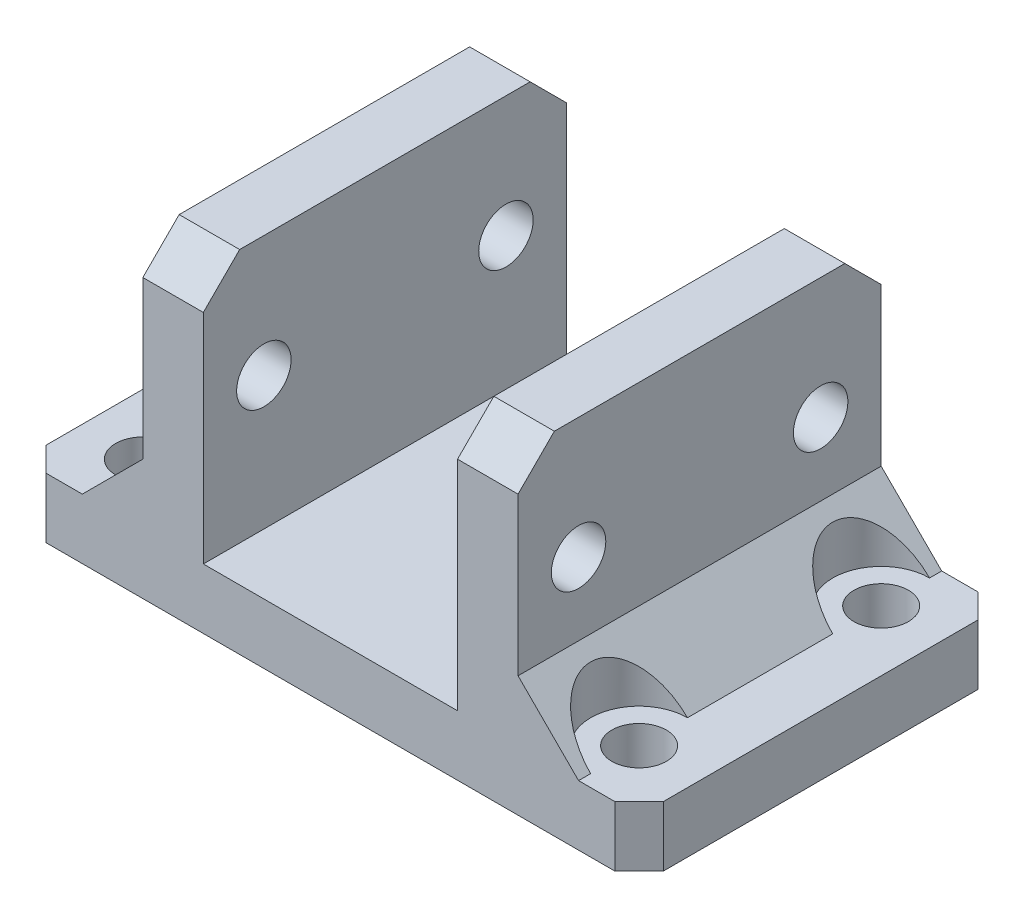
ISO-10303-21;
HEADER;
FILE_DESCRIPTION(('STEP AP214'),'2;1');
FILE_NAME('part.step','',(''),(''),'','','');
FILE_SCHEMA(('AUTOMOTIVE_DESIGN { 1 0 10303 214 1 1 1 1 }'));
ENDSEC;
DATA;
#1=APPLICATION_CONTEXT('core data for automotive mechanical design processes');
#2=APPLICATION_PROTOCOL_DEFINITION('international standard','automotive_design',2000,#1);
#3=PRODUCT_CONTEXT('',#1,'mechanical');
#4=PRODUCT('Part','Part','',(#3));
#5=PRODUCT_RELATED_PRODUCT_CATEGORY('part','',(#4));
#6=PRODUCT_DEFINITION_FORMATION('','',#4);
#7=PRODUCT_DEFINITION_CONTEXT('part definition',#1,'design');
#8=PRODUCT_DEFINITION('design','',#6,#7);
#9=PRODUCT_DEFINITION_SHAPE('','',#8);
#10=(LENGTH_UNIT() NAMED_UNIT(*) SI_UNIT(.MILLI.,.METRE.));
#11=(NAMED_UNIT(*) PLANE_ANGLE_UNIT() SI_UNIT($,.RADIAN.));
#12=(NAMED_UNIT(*) SI_UNIT($,.STERADIAN.) SOLID_ANGLE_UNIT());
#13=UNCERTAINTY_MEASURE_WITH_UNIT(LENGTH_MEASURE(1.E-05),#10,'distance_accuracy_value','');
#14=(GEOMETRIC_REPRESENTATION_CONTEXT(3) GLOBAL_UNCERTAINTY_ASSIGNED_CONTEXT((#13)) GLOBAL_UNIT_ASSIGNED_CONTEXT((#10,
#11,#12)) REPRESENTATION_CONTEXT('',''));
#15=CARTESIAN_POINT('',(0.,0.,0.));
#16=DIRECTION('',(0.,0.,1.));
#17=DIRECTION('',(1.,0.,0.));
#18=AXIS2_PLACEMENT_3D('',#15,#16,#17);
#19=CARTESIAN_POINT('',(-21.,-16.,-25.));
#20=DIRECTION('',(0.,1.,0.));
#21=DIRECTION('',(-1.,0.,0.));
#22=AXIS2_PLACEMENT_3D('',#19,#20,#21);
#23=CYLINDRICAL_SURFACE('',#22,2.25);
#24=CARTESIAN_POINT('',(-21.,-15.9757649115337,-25.));
#25=DIRECTION('',(0.,1.,0.));
#26=DIRECTION('',(0.,0.,1.));
#27=AXIS2_PLACEMENT_3D('',#24,#25,#26);
#28=CIRCLE('',#27,2.25);
#29=CARTESIAN_POINT('',(-21.,-15.9757649115337,-22.75));
#30=VERTEX_POINT('',#29);
#31=EDGE_CURVE('E432',#30,#30,#28,.F.);
#32=ORIENTED_EDGE('',*,*,#31,.T.);
#33=EDGE_LOOP('',(#32));
#34=FACE_BOUND('',#33,.T.);
#35=CARTESIAN_POINT('',(-21.,-11.,-25.));
#36=DIRECTION('',(0.,1.,0.));
#37=DIRECTION('',(-1.,0.,0.));
#38=AXIS2_PLACEMENT_3D('',#35,#36,#37);
#39=CIRCLE('',#38,2.25);
#40=CARTESIAN_POINT('',(-23.25,-11.,-25.));
#41=VERTEX_POINT('',#40);
#42=EDGE_CURVE('E436',#41,#41,#39,.F.);
#43=ORIENTED_EDGE('',*,*,#42,.F.);
#44=EDGE_LOOP('',(#43));
#45=FACE_BOUND('',#44,.T.);
#46=ADVANCED_FACE('F56',(#34,#45),#23,.F.);
#47=CARTESIAN_POINT('',(20.,-16.,-4.99999999999999));
#48=DIRECTION('',(0.,1.,0.));
#49=DIRECTION('',(-1.,0.,0.));
#50=AXIS2_PLACEMENT_3D('',#47,#48,#49);
#51=CYLINDRICAL_SURFACE('',#50,2.25);
#52=CARTESIAN_POINT('',(20.,-15.9757649115337,-4.99999999999999));
#53=DIRECTION('',(0.,1.,0.));
#54=DIRECTION('',(0.,0.,1.));
#55=AXIS2_PLACEMENT_3D('',#52,#53,#54);
#56=CIRCLE('',#55,2.25);
#57=CARTESIAN_POINT('',(20.,-15.9757649115337,-2.74999999999999));
#58=VERTEX_POINT('',#57);
#59=EDGE_CURVE('E428',#58,#58,#56,.T.);
#60=ORIENTED_EDGE('',*,*,#59,.F.);
#61=EDGE_LOOP('',(#60));
#62=FACE_BOUND('',#61,.T.);
#63=CARTESIAN_POINT('',(20.,-11.,-4.99999999999999));
#64=DIRECTION('',(0.,1.,0.));
#65=DIRECTION('',(-1.,0.,0.));
#66=AXIS2_PLACEMENT_3D('',#63,#64,#65);
#67=CIRCLE('',#66,2.25);
#68=CARTESIAN_POINT('',(17.75,-11.,-4.99999999999999));
#69=VERTEX_POINT('',#68);
#70=EDGE_CURVE('E568',#69,#69,#67,.T.);
#71=ORIENTED_EDGE('',*,*,#70,.T.);
#72=EDGE_LOOP('',(#71));
#73=FACE_BOUND('',#72,.T.);
#74=ADVANCED_FACE('F632',(#62,#73),#51,.F.);
#75=CARTESIAN_POINT('',(20.,-16.,-25.));
#76=DIRECTION('',(0.,1.,0.));
#77=DIRECTION('',(-1.,0.,0.));
#78=AXIS2_PLACEMENT_3D('',#75,#76,#77);
#79=CYLINDRICAL_SURFACE('',#78,2.25);
#80=CARTESIAN_POINT('',(20.,-15.9757649115337,-25.));
#81=DIRECTION('',(0.,1.,0.));
#82=DIRECTION('',(0.,0.,1.));
#83=AXIS2_PLACEMENT_3D('',#80,#81,#82);
#84=CIRCLE('',#83,2.25);
#85=CARTESIAN_POINT('',(20.,-15.9757649115337,-22.75));
#86=VERTEX_POINT('',#85);
#87=EDGE_CURVE('E424',#86,#86,#84,.T.);
#88=ORIENTED_EDGE('',*,*,#87,.F.);
#89=EDGE_LOOP('',(#88));
#90=FACE_BOUND('',#89,.T.);
#91=CARTESIAN_POINT('',(20.,-11.,-25.));
#92=DIRECTION('',(0.,1.,0.));
#93=DIRECTION('',(-1.,0.,0.));
#94=AXIS2_PLACEMENT_3D('',#91,#92,#93);
#95=CIRCLE('',#94,2.25);
#96=CARTESIAN_POINT('',(17.75,-11.,-25.));
#97=VERTEX_POINT('',#96);
#98=EDGE_CURVE('E564',#97,#97,#95,.T.);
#99=ORIENTED_EDGE('',*,*,#98,.T.);
#100=EDGE_LOOP('',(#99));
#101=FACE_BOUND('',#100,.T.);
#102=ADVANCED_FACE('F638',(#90,#101),#79,.F.);
#103=CARTESIAN_POINT('',(-21.,-16.,-4.99999999999998));
#104=DIRECTION('',(0.,1.,0.));
#105=DIRECTION('',(-1.,0.,0.));
#106=AXIS2_PLACEMENT_3D('',#103,#104,#105);
#107=CYLINDRICAL_SURFACE('',#106,2.25);
#108=CARTESIAN_POINT('',(-21.,-15.9757649115337,-4.99999999999998));
#109=DIRECTION('',(0.,1.,0.));
#110=DIRECTION('',(0.,0.,1.));
#111=AXIS2_PLACEMENT_3D('',#108,#109,#110);
#112=CIRCLE('',#111,2.25);
#113=CARTESIAN_POINT('',(-21.,-15.9757649115337,-2.74999999999998));
#114=VERTEX_POINT('',#113);
#115=EDGE_CURVE('E419',#114,#114,#112,.F.);
#116=ORIENTED_EDGE('',*,*,#115,.T.);
#117=EDGE_LOOP('',(#116));
#118=FACE_BOUND('',#117,.T.);
#119=CARTESIAN_POINT('',(-21.,-11.,-4.99999999999998));
#120=DIRECTION('',(0.,1.,0.));
#121=DIRECTION('',(-1.,0.,0.));
#122=AXIS2_PLACEMENT_3D('',#119,#120,#121);
#123=CIRCLE('',#122,2.25);
#124=CARTESIAN_POINT('',(-23.25,-11.,-4.99999999999998));
#125=VERTEX_POINT('',#124);
#126=EDGE_CURVE('E563',#125,#125,#123,.F.);
#127=ORIENTED_EDGE('',*,*,#126,.F.);
#128=EDGE_LOOP('',(#127));
#129=FACE_BOUND('',#128,.T.);
#130=ADVANCED_FACE('F761',(#118,#129),#107,.F.);
#131=CARTESIAN_POINT('',(20.,-11.,-30.));
#132=DIRECTION('',(0.707106781186544,0.707106781186551,0.));
#133=DIRECTION('',(0.,0.,-1.));
#134=AXIS2_PLACEMENT_3D('',#131,#132,#133);
#135=PLANE('',#134);
#136=CARTESIAN_POINT('',(20.,-11.,-25.));
#137=DIRECTION('',(0.707106781186544,0.707106781186551,0.));
#138=DIRECTION('',(0.707106781186552,-0.707106781186544,0.));
#139=AXIS2_PLACEMENT_3D('',#136,#137,#138);
#140=ELLIPSE('',#139,5.65685424949235,4.);
#141=CARTESIAN_POINT('',(20.,-11.,-29.));
#142=VERTEX_POINT('',#141);
#143=CARTESIAN_POINT('',(20.,-11.,-21.));
#144=VERTEX_POINT('',#143);
#145=EDGE_CURVE('E240',#142,#144,#140,.T.);
#146=ORIENTED_EDGE('',*,*,#145,.F.);
#147=DIRECTION('',(0.,0.,1.));
#148=VECTOR('',#147,1.);
#149=CARTESIAN_POINT('',(20.,-11.,0.));
#150=LINE('',#149,#148);
#151=CARTESIAN_POINT('',(20.,-11.,-30.));
#152=VERTEX_POINT('',#151);
#153=EDGE_CURVE('E261',#152,#142,#150,.T.);
#154=ORIENTED_EDGE('',*,*,#153,.F.);
#155=DIRECTION('',(-0.707106781186552,0.707106781186544,0.));
#156=VECTOR('',#155,1.);
#157=CARTESIAN_POINT('',(4.49999999999991,4.49999999999995,-30.));
#158=LINE('',#157,#156);
#159=CARTESIAN_POINT('',(15.,-6.00000000000003,-30.));
#160=VERTEX_POINT('',#159);
#161=EDGE_CURVE('E241',#160,#152,#158,.F.);
#162=ORIENTED_EDGE('',*,*,#161,.F.);
#163=DIRECTION('',(0.,0.,-1.));
#164=VECTOR('',#163,1.);
#165=CARTESIAN_POINT('',(15.,-6.00000000000003,-30.));
#166=LINE('',#165,#164);
#167=CARTESIAN_POINT('',(15.,-6.00000000000003,0.));
#168=VERTEX_POINT('',#167);
#169=EDGE_CURVE('E73',#168,#160,#166,.T.);
#170=ORIENTED_EDGE('',*,*,#169,.F.);
#171=DIRECTION('',(0.707106781186552,-0.707106781186544,0.));
#172=VECTOR('',#171,1.);
#173=CARTESIAN_POINT('',(20.,-11.,0.));
#174=LINE('',#173,#172);
#175=CARTESIAN_POINT('',(20.,-11.,0.));
#176=VERTEX_POINT('',#175);
#177=EDGE_CURVE('E81',#176,#168,#174,.F.);
#178=ORIENTED_EDGE('',*,*,#177,.F.);
#179=DIRECTION('',(0.,0.,1.));
#180=VECTOR('',#179,1.);
#181=CARTESIAN_POINT('',(20.,-11.,0.));
#182=LINE('',#181,#180);
#183=CARTESIAN_POINT('',(20.,-11.,-0.999999999999987));
#184=VERTEX_POINT('',#183);
#185=EDGE_CURVE('E248',#184,#176,#182,.T.);
#186=ORIENTED_EDGE('',*,*,#185,.F.);
#187=CARTESIAN_POINT('',(20.,-11.,-4.99999999999999));
#188=DIRECTION('',(0.707106781186544,0.707106781186551,0.));
#189=DIRECTION('',(0.707106781186552,-0.707106781186544,0.));
#190=AXIS2_PLACEMENT_3D('',#187,#188,#189);
#191=ELLIPSE('',#190,5.65685424949235,4.);
#192=CARTESIAN_POINT('',(20.,-11.,-8.99999999999998));
#193=VERTEX_POINT('',#192);
#194=EDGE_CURVE('E231',#193,#184,#191,.T.);
#195=ORIENTED_EDGE('',*,*,#194,.F.);
#196=DIRECTION('',(0.,0.,1.));
#197=VECTOR('',#196,1.);
#198=CARTESIAN_POINT('',(20.,-11.,0.));
#199=LINE('',#198,#197);
#200=EDGE_CURVE('E250',#144,#193,#199,.T.);
#201=ORIENTED_EDGE('',*,*,#200,.F.);
#202=EDGE_LOOP('',(#146,#154,#162,#170,#178,#186,#195,#201));
#203=FACE_BOUND('',#202,.T.);
#204=ADVANCED_FACE('F59',(#203),#135,.T.);
#205=CARTESIAN_POINT('',(0.,-15.9757649115337,-30.));
#206=DIRECTION('',(0.,1.,0.));
#207=DIRECTION('',(0.,0.,1.));
#208=AXIS2_PLACEMENT_3D('',#205,#206,#207);
#209=PLANE('',#208);
#210=ORIENTED_EDGE('',*,*,#115,.F.);
#211=EDGE_LOOP('',(#210));
#212=FACE_BOUND('',#211,.T.);
#213=ORIENTED_EDGE('',*,*,#59,.T.);
#214=EDGE_LOOP('',(#213));
#215=FACE_BOUND('',#214,.T.);
#216=ORIENTED_EDGE('',*,*,#31,.F.);
#217=EDGE_LOOP('',(#216));
#218=FACE_BOUND('',#217,.T.);
#219=DIRECTION('',(-1.,0.,0.));
#220=VECTOR('',#219,1.);
#221=CARTESIAN_POINT('',(0.,-15.9757649115337,-30.));
#222=LINE('',#221,#220);
#223=CARTESIAN_POINT('',(23.,-15.9757649115337,-30.));
#224=VERTEX_POINT('',#223);
#225=CARTESIAN_POINT('',(-24.,-15.9757649115337,-30.));
#226=VERTEX_POINT('',#225);
#227=EDGE_CURVE('E480',#224,#226,#222,.T.);
#228=ORIENTED_EDGE('',*,*,#227,.F.);
#229=DIRECTION('',(0.707106781186549,0.,0.707106781186546));
#230=VECTOR('',#229,1.);
#231=CARTESIAN_POINT('',(25.,-15.9757649115337,-28.));
#232=LINE('',#231,#230);
#233=CARTESIAN_POINT('',(25.,-15.9757649115337,-28.));
#234=VERTEX_POINT('',#233);
#235=EDGE_CURVE('E331',#224,#234,#232,.T.);
#236=ORIENTED_EDGE('',*,*,#235,.T.);
#237=DIRECTION('',(0.,0.,1.));
#238=VECTOR('',#237,1.);
#239=CARTESIAN_POINT('',(25.,-15.9757649115337,-30.));
#240=LINE('',#239,#238);
#241=CARTESIAN_POINT('',(25.,-15.9757649115337,-2.00000000000002));
#242=VERTEX_POINT('',#241);
#243=EDGE_CURVE('E441',#234,#242,#240,.T.);
#244=ORIENTED_EDGE('',*,*,#243,.T.);
#245=DIRECTION('',(0.707106781186545,0.,-0.70710678118655));
#246=VECTOR('',#245,1.);
#247=CARTESIAN_POINT('',(23.,-15.9757649115337,0.));
#248=LINE('',#247,#246);
#249=CARTESIAN_POINT('',(23.,-15.9757649115337,0.));
#250=VERTEX_POINT('',#249);
#251=EDGE_CURVE('E334',#242,#250,#248,.F.);
#252=ORIENTED_EDGE('',*,*,#251,.T.);
#253=DIRECTION('',(-1.,0.,0.));
#254=VECTOR('',#253,1.);
#255=CARTESIAN_POINT('',(0.,-15.9757649115337,0.));
#256=LINE('',#255,#254);
#257=CARTESIAN_POINT('',(-24.,-15.9757649115337,0.));
#258=VERTEX_POINT('',#257);
#259=EDGE_CURVE('E500',#250,#258,#256,.T.);
#260=ORIENTED_EDGE('',*,*,#259,.T.);
#261=DIRECTION('',(-0.70710678118655,0.,-0.707106781186545));
#262=VECTOR('',#261,1.);
#263=CARTESIAN_POINT('',(-26.,-15.9757649115337,-2.00000000000002));
#264=LINE('',#263,#262);
#265=CARTESIAN_POINT('',(-26.,-15.9757649115337,-2.00000000000002));
#266=VERTEX_POINT('',#265);
#267=EDGE_CURVE('E337',#258,#266,#264,.T.);
#268=ORIENTED_EDGE('',*,*,#267,.T.);
#269=DIRECTION('',(0.,0.,1.));
#270=VECTOR('',#269,1.);
#271=CARTESIAN_POINT('',(-26.,-15.9757649115337,-30.));
#272=LINE('',#271,#270);
#273=CARTESIAN_POINT('',(-26.,-15.9757649115337,-28.));
#274=VERTEX_POINT('',#273);
#275=EDGE_CURVE('E437',#274,#266,#272,.T.);
#276=ORIENTED_EDGE('',*,*,#275,.F.);
#277=DIRECTION('',(-0.707106781186545,0.,0.70710678118655));
#278=VECTOR('',#277,1.);
#279=CARTESIAN_POINT('',(-24.,-15.9757649115337,-30.));
#280=LINE('',#279,#278);
#281=EDGE_CURVE('E340',#274,#226,#280,.F.);
#282=ORIENTED_EDGE('',*,*,#281,.T.);
#283=EDGE_LOOP('',(#228,#236,#244,#252,#260,#268,#276,#282));
#284=FACE_BOUND('',#283,.T.);
#285=ORIENTED_EDGE('',*,*,#87,.T.);
#286=EDGE_LOOP('',(#285));
#287=FACE_BOUND('',#286,.T.);
#288=ADVANCED_FACE('F614',(#212,#215,#218,#284,#287),#209,.F.);
#289=CARTESIAN_POINT('',(-26.,0.,-30.));
#290=DIRECTION('',(1.,0.,0.));
#291=DIRECTION('',(0.,0.,-1.));
#292=AXIS2_PLACEMENT_3D('',#289,#290,#291);
#293=PLANE('',#292);
#294=ORIENTED_EDGE('',*,*,#275,.T.);
#295=DIRECTION('',(0.,1.,0.));
#296=VECTOR('',#295,1.);
#297=CARTESIAN_POINT('',(-26.,-11.,-2.00000000000002));
#298=LINE('',#297,#296);
#299=CARTESIAN_POINT('',(-26.,-11.,-2.00000000000002));
#300=VERTEX_POINT('',#299);
#301=EDGE_CURVE('E317',#266,#300,#298,.T.);
#302=ORIENTED_EDGE('',*,*,#301,.T.);
#303=DIRECTION('',(0.,0.,1.));
#304=VECTOR('',#303,1.);
#305=CARTESIAN_POINT('',(-26.,-11.,-30.));
#306=LINE('',#305,#304);
#307=CARTESIAN_POINT('',(-26.,-11.,-28.));
#308=VERTEX_POINT('',#307);
#309=EDGE_CURVE('E418',#308,#300,#306,.T.);
#310=ORIENTED_EDGE('',*,*,#309,.F.);
#311=DIRECTION('',(0.,-1.,0.));
#312=VECTOR('',#311,1.);
#313=CARTESIAN_POINT('',(-26.,0.,-28.));
#314=LINE('',#313,#312);
#315=EDGE_CURVE('E321',#308,#274,#314,.T.);
#316=ORIENTED_EDGE('',*,*,#315,.T.);
#317=EDGE_LOOP('',(#294,#302,#310,#316));
#318=FACE_BOUND('',#317,.T.);
#319=ADVANCED_FACE('F610',(#318),#293,.F.);
#320=CARTESIAN_POINT('',(0.,-11.,-30.));
#321=DIRECTION('',(0.,1.,0.));
#322=DIRECTION('',(0.,0.,1.));
#323=AXIS2_PLACEMENT_3D('',#320,#321,#322);
#324=PLANE('',#323);
#325=DIRECTION('',(0.,0.,-1.));
#326=VECTOR('',#325,1.);
#327=CARTESIAN_POINT('',(-21.,-11.,-30.));
#328=LINE('',#327,#326);
#329=CARTESIAN_POINT('',(-21.,-11.,0.));
#330=VERTEX_POINT('',#329);
#331=CARTESIAN_POINT('',(-21.,-11.,-0.999999999999973));
#332=VERTEX_POINT('',#331);
#333=EDGE_CURVE('E256',#330,#332,#328,.T.);
#334=ORIENTED_EDGE('',*,*,#333,.T.);
#335=CARTESIAN_POINT('',(-21.,-11.,-4.99999999999998));
#336=DIRECTION('',(0.,1.,0.));
#337=DIRECTION('',(-1.,0.,0.));
#338=AXIS2_PLACEMENT_3D('',#335,#336,#337);
#339=CIRCLE('',#338,3.99999999999999);
#340=CARTESIAN_POINT('',(-21.,-11.,-8.99999999999998));
#341=VERTEX_POINT('',#340);
#342=EDGE_CURVE('E300',#341,#332,#339,.F.);
#343=ORIENTED_EDGE('',*,*,#342,.F.);
#344=DIRECTION('',(0.,0.,-1.));
#345=VECTOR('',#344,1.);
#346=CARTESIAN_POINT('',(-21.,-11.,-30.));
#347=LINE('',#346,#345);
#348=CARTESIAN_POINT('',(-21.,-11.,-21.));
#349=VERTEX_POINT('',#348);
#350=EDGE_CURVE('E264',#341,#349,#347,.T.);
#351=ORIENTED_EDGE('',*,*,#350,.T.);
#352=CARTESIAN_POINT('',(-21.,-11.,-25.));
#353=DIRECTION('',(0.,1.,0.));
#354=DIRECTION('',(-1.,0.,0.));
#355=AXIS2_PLACEMENT_3D('',#352,#353,#354);
#356=CIRCLE('',#355,4.);
#357=CARTESIAN_POINT('',(-21.,-11.,-29.));
#358=VERTEX_POINT('',#357);
#359=EDGE_CURVE('E299',#358,#349,#356,.F.);
#360=ORIENTED_EDGE('',*,*,#359,.F.);
#361=DIRECTION('',(0.,0.,-1.));
#362=VECTOR('',#361,1.);
#363=CARTESIAN_POINT('',(-21.,-11.,-30.));
#364=LINE('',#363,#362);
#365=CARTESIAN_POINT('',(-21.,-11.,-30.));
#366=VERTEX_POINT('',#365);
#367=EDGE_CURVE('E292',#358,#366,#364,.T.);
#368=ORIENTED_EDGE('',*,*,#367,.T.);
#369=DIRECTION('',(-1.,0.,0.));
#370=VECTOR('',#369,1.);
#371=CARTESIAN_POINT('',(0.,-11.,-30.));
#372=LINE('',#371,#370);
#373=CARTESIAN_POINT('',(-24.,-11.,-30.));
#374=VERTEX_POINT('',#373);
#375=EDGE_CURVE('E442',#366,#374,#372,.T.);
#376=ORIENTED_EDGE('',*,*,#375,.T.);
#377=DIRECTION('',(0.707106781186545,0.,-0.70710678118655));
#378=VECTOR('',#377,1.);
#379=CARTESIAN_POINT('',(-12.0000000000001,-11.,-42.));
#380=LINE('',#379,#378);
#381=EDGE_CURVE('E314',#374,#308,#380,.F.);
#382=ORIENTED_EDGE('',*,*,#381,.T.);
#383=ORIENTED_EDGE('',*,*,#309,.T.);
#384=DIRECTION('',(0.70710678118655,0.,0.707106781186545));
#385=VECTOR('',#384,1.);
#386=CARTESIAN_POINT('',(-26.9999999999999,-11.,-2.99999999999992));
#387=LINE('',#386,#385);
#388=CARTESIAN_POINT('',(-24.,-11.,0.));
#389=VERTEX_POINT('',#388);
#390=EDGE_CURVE('E310',#300,#389,#387,.T.);
#391=ORIENTED_EDGE('',*,*,#390,.T.);
#392=DIRECTION('',(-1.,0.,0.));
#393=VECTOR('',#392,1.);
#394=CARTESIAN_POINT('',(0.,-11.,0.));
#395=LINE('',#394,#393);
#396=EDGE_CURVE('E477',#330,#389,#395,.T.);
#397=ORIENTED_EDGE('',*,*,#396,.F.);
#398=EDGE_LOOP('',(#334,#343,#351,#360,#368,#376,#382,#383,#391,#397));
#399=FACE_BOUND('',#398,.T.);
#400=ORIENTED_EDGE('',*,*,#42,.T.);
#401=EDGE_LOOP('',(#400));
#402=FACE_BOUND('',#401,.T.);
#403=ORIENTED_EDGE('',*,*,#126,.T.);
#404=EDGE_LOOP('',(#403));
#405=FACE_BOUND('',#404,.T.);
#406=ADVANCED_FACE('F297',(#399,#402,#405),#324,.T.);
#407=CARTESIAN_POINT('',(-16.,0.,-30.));
#408=DIRECTION('',(1.,0.,0.));
#409=DIRECTION('',(0.,0.,-1.));
#410=AXIS2_PLACEMENT_3D('',#407,#408,#409);
#411=PLANE('',#410);
#412=CARTESIAN_POINT('',(-16.,0.,-25.));
#413=DIRECTION('',(1.,0.,0.));
#414=DIRECTION('',(0.,0.,-1.));
#415=AXIS2_PLACEMENT_3D('',#412,#413,#414);
#416=CIRCLE('',#415,2.25);
#417=CARTESIAN_POINT('',(-16.,0.,-27.25));
#418=VERTEX_POINT('',#417);
#419=EDGE_CURVE('E545',#418,#418,#416,.T.);
#420=ORIENTED_EDGE('',*,*,#419,.T.);
#421=EDGE_LOOP('',(#420));
#422=FACE_BOUND('',#421,.T.);
#423=CARTESIAN_POINT('',(-16.,0.,-5.));
#424=DIRECTION('',(1.,0.,0.));
#425=DIRECTION('',(0.,0.,-1.));
#426=AXIS2_PLACEMENT_3D('',#423,#424,#425);
#427=CIRCLE('',#426,2.25);
#428=CARTESIAN_POINT('',(-16.,0.,-7.25000000000001));
#429=VERTEX_POINT('',#428);
#430=EDGE_CURVE('E549',#429,#429,#427,.T.);
#431=ORIENTED_EDGE('',*,*,#430,.T.);
#432=EDGE_LOOP('',(#431));
#433=FACE_BOUND('',#432,.T.);
#434=DIRECTION('',(0.,1.,0.));
#435=VECTOR('',#434,1.);
#436=CARTESIAN_POINT('',(-16.,0.,-30.));
#437=LINE('',#436,#435);
#438=CARTESIAN_POINT('',(-16.,-5.99999999999998,-30.));
#439=VERTEX_POINT('',#438);
#440=CARTESIAN_POINT('',(-16.,6.99999999999998,-30.));
#441=VERTEX_POINT('',#440);
#442=EDGE_CURVE('E507',#439,#441,#437,.T.);
#443=ORIENTED_EDGE('',*,*,#442,.F.);
#444=DIRECTION('',(0.,0.,1.));
#445=VECTOR('',#444,1.);
#446=CARTESIAN_POINT('',(-16.,-5.99999999999998,-30.));
#447=LINE('',#446,#445);
#448=CARTESIAN_POINT('',(-16.,-5.99999999999998,0.));
#449=VERTEX_POINT('',#448);
#450=EDGE_CURVE('E304',#439,#449,#447,.T.);
#451=ORIENTED_EDGE('',*,*,#450,.T.);
#452=DIRECTION('',(0.,1.,0.));
#453=VECTOR('',#452,1.);
#454=CARTESIAN_POINT('',(-16.,0.,0.));
#455=LINE('',#454,#453);
#456=CARTESIAN_POINT('',(-16.,6.99999999999998,0.));
#457=VERTEX_POINT('',#456);
#458=EDGE_CURVE('E481',#449,#457,#455,.T.);
#459=ORIENTED_EDGE('',*,*,#458,.T.);
#460=DIRECTION('',(0.,-0.707106781186547,0.707106781186549));
#461=VECTOR('',#460,1.);
#462=CARTESIAN_POINT('',(-16.,6.99999999999998,0.));
#463=LINE('',#462,#461);
#464=CARTESIAN_POINT('',(-16.,10.,-3.00000000000004));
#465=VERTEX_POINT('',#464);
#466=EDGE_CURVE('E403',#457,#465,#463,.F.);
#467=ORIENTED_EDGE('',*,*,#466,.T.);
#468=DIRECTION('',(0.,0.,1.));
#469=VECTOR('',#468,1.);
#470=CARTESIAN_POINT('',(-16.,10.,-30.));
#471=LINE('',#470,#469);
#472=CARTESIAN_POINT('',(-16.,10.,-27.));
#473=VERTEX_POINT('',#472);
#474=EDGE_CURVE('E470',#473,#465,#471,.T.);
#475=ORIENTED_EDGE('',*,*,#474,.F.);
#476=DIRECTION('',(0.,-0.707106781186548,-0.707106781186547));
#477=VECTOR('',#476,1.);
#478=CARTESIAN_POINT('',(-16.,10.,-27.));
#479=LINE('',#478,#477);
#480=EDGE_CURVE('E406',#473,#441,#479,.T.);
#481=ORIENTED_EDGE('',*,*,#480,.T.);
#482=EDGE_LOOP('',(#443,#451,#459,#467,#475,#481));
#483=FACE_BOUND('',#482,.T.);
#484=ADVANCED_FACE('F592',(#422,#433,#483),#411,.F.);
#485=CARTESIAN_POINT('',(0.,10.,-30.));
#486=DIRECTION('',(0.,1.,0.));
#487=DIRECTION('',(0.,0.,1.));
#488=AXIS2_PLACEMENT_3D('',#485,#486,#487);
#489=PLANE('',#488);
#490=ORIENTED_EDGE('',*,*,#474,.T.);
#491=DIRECTION('',(1.,0.,0.));
#492=VECTOR('',#491,1.);
#493=CARTESIAN_POINT('',(0.,10.,-3.));
#494=LINE('',#493,#492);
#495=CARTESIAN_POINT('',(-11.,10.,-3.00000000000006));
#496=VERTEX_POINT('',#495);
#497=EDGE_CURVE('E396',#465,#496,#494,.T.);
#498=ORIENTED_EDGE('',*,*,#497,.T.);
#499=DIRECTION('',(0.,0.,1.));
#500=VECTOR('',#499,1.);
#501=CARTESIAN_POINT('',(-11.,10.,-30.));
#502=LINE('',#501,#500);
#503=CARTESIAN_POINT('',(-11.,10.,-27.));
#504=VERTEX_POINT('',#503);
#505=EDGE_CURVE('E466',#504,#496,#502,.T.);
#506=ORIENTED_EDGE('',*,*,#505,.F.);
#507=DIRECTION('',(-1.,0.,0.));
#508=VECTOR('',#507,1.);
#509=CARTESIAN_POINT('',(-16.,10.,-27.));
#510=LINE('',#509,#508);
#511=EDGE_CURVE('E399',#504,#473,#510,.T.);
#512=ORIENTED_EDGE('',*,*,#511,.T.);
#513=EDGE_LOOP('',(#490,#498,#506,#512));
#514=FACE_BOUND('',#513,.T.);
#515=ADVANCED_FACE('F664',(#514),#489,.T.);
#516=CARTESIAN_POINT('',(-11.,0.,-30.));
#517=DIRECTION('',(-1.,0.,0.));
#518=DIRECTION('',(0.,-1.,0.));
#519=AXIS2_PLACEMENT_3D('',#516,#517,#518);
#520=PLANE('',#519);
#521=CARTESIAN_POINT('',(-11.,0.,-25.));
#522=DIRECTION('',(-1.,0.,0.));
#523=DIRECTION('',(0.,-1.,0.));
#524=AXIS2_PLACEMENT_3D('',#521,#522,#523);
#525=CIRCLE('',#524,2.25);
#526=CARTESIAN_POINT('',(-11.,-2.25,-25.));
#527=VERTEX_POINT('',#526);
#528=EDGE_CURVE('E504',#527,#527,#525,.T.);
#529=ORIENTED_EDGE('',*,*,#528,.T.);
#530=EDGE_LOOP('',(#529));
#531=FACE_BOUND('',#530,.T.);
#532=CARTESIAN_POINT('',(-11.,0.,-5.));
#533=DIRECTION('',(-1.,0.,0.));
#534=DIRECTION('',(0.,-1.,0.));
#535=AXIS2_PLACEMENT_3D('',#532,#533,#534);
#536=CIRCLE('',#535,2.25);
#537=CARTESIAN_POINT('',(-11.,-2.25,-5.));
#538=VERTEX_POINT('',#537);
#539=EDGE_CURVE('E537',#538,#538,#536,.T.);
#540=ORIENTED_EDGE('',*,*,#539,.T.);
#541=EDGE_LOOP('',(#540));
#542=FACE_BOUND('',#541,.T.);
#543=ORIENTED_EDGE('',*,*,#505,.T.);
#544=DIRECTION('',(0.,0.707106781186547,-0.707106781186549));
#545=VECTOR('',#544,1.);
#546=CARTESIAN_POINT('',(-11.,6.99999999999998,0.));
#547=LINE('',#546,#545);
#548=CARTESIAN_POINT('',(-11.,6.99999999999998,0.));
#549=VERTEX_POINT('',#548);
#550=EDGE_CURVE('E390',#496,#549,#547,.F.);
#551=ORIENTED_EDGE('',*,*,#550,.T.);
#552=DIRECTION('',(0.,-1.,0.));
#553=VECTOR('',#552,1.);
#554=CARTESIAN_POINT('',(-11.,0.,0.));
#555=LINE('',#554,#553);
#556=CARTESIAN_POINT('',(-11.,-11.,0.));
#557=VERTEX_POINT('',#556);
#558=EDGE_CURVE('E484',#549,#557,#555,.T.);
#559=ORIENTED_EDGE('',*,*,#558,.T.);
#560=DIRECTION('',(0.,0.,1.));
#561=VECTOR('',#560,1.);
#562=CARTESIAN_POINT('',(-11.,-11.,-30.));
#563=LINE('',#562,#561);
#564=CARTESIAN_POINT('',(-11.,-11.,-30.));
#565=VERTEX_POINT('',#564);
#566=EDGE_CURVE('E462',#565,#557,#563,.T.);
#567=ORIENTED_EDGE('',*,*,#566,.F.);
#568=DIRECTION('',(0.,-1.,0.));
#569=VECTOR('',#568,1.);
#570=CARTESIAN_POINT('',(-11.,0.,-30.));
#571=LINE('',#570,#569);
#572=CARTESIAN_POINT('',(-11.,6.99999999999998,-30.));
#573=VERTEX_POINT('',#572);
#574=EDGE_CURVE('E510',#573,#565,#571,.T.);
#575=ORIENTED_EDGE('',*,*,#574,.F.);
#576=DIRECTION('',(0.,0.707106781186548,0.707106781186547));
#577=VECTOR('',#576,1.);
#578=CARTESIAN_POINT('',(-11.,10.,-27.));
#579=LINE('',#578,#577);
#580=EDGE_CURVE('E393',#573,#504,#579,.T.);
#581=ORIENTED_EDGE('',*,*,#580,.T.);
#582=EDGE_LOOP('',(#543,#551,#559,#567,#575,#581));
#583=FACE_BOUND('',#582,.T.);
#584=ADVANCED_FACE('F668',(#531,#542,#583),#520,.F.);
#585=CARTESIAN_POINT('',(0.,-11.,-30.));
#586=DIRECTION('',(0.,-1.,0.));
#587=DIRECTION('',(1.,0.,0.));
#588=AXIS2_PLACEMENT_3D('',#585,#586,#587);
#589=PLANE('',#588);
#590=DIRECTION('',(1.,0.,0.));
#591=VECTOR('',#590,1.);
#592=CARTESIAN_POINT('',(0.,-11.,0.));
#593=LINE('',#592,#591);
#594=CARTESIAN_POINT('',(10.,-11.,0.));
#595=VERTEX_POINT('',#594);
#596=EDGE_CURVE('E487',#557,#595,#593,.T.);
#597=ORIENTED_EDGE('',*,*,#596,.T.);
#598=DIRECTION('',(0.,0.,1.));
#599=VECTOR('',#598,1.);
#600=CARTESIAN_POINT('',(10.,-11.,-30.));
#601=LINE('',#600,#599);
#602=CARTESIAN_POINT('',(10.,-11.,-30.));
#603=VERTEX_POINT('',#602);
#604=EDGE_CURVE('E458',#603,#595,#601,.T.);
#605=ORIENTED_EDGE('',*,*,#604,.F.);
#606=DIRECTION('',(1.,0.,0.));
#607=VECTOR('',#606,1.);
#608=CARTESIAN_POINT('',(0.,-11.,-30.));
#609=LINE('',#608,#607);
#610=EDGE_CURVE('E513',#565,#603,#609,.T.);
#611=ORIENTED_EDGE('',*,*,#610,.F.);
#612=ORIENTED_EDGE('',*,*,#566,.T.);
#613=EDGE_LOOP('',(#597,#605,#611,#612));
#614=FACE_BOUND('',#613,.T.);
#615=ADVANCED_FACE('F672',(#614),#589,.F.);
#616=CARTESIAN_POINT('',(10.,0.,-30.));
#617=DIRECTION('',(-1.,0.,0.));
#618=DIRECTION('',(0.,-1.,0.));
#619=AXIS2_PLACEMENT_3D('',#616,#617,#618);
#620=PLANE('',#619);
#621=CARTESIAN_POINT('',(10.,0.,-25.));
#622=DIRECTION('',(-1.,0.,0.));
#623=DIRECTION('',(0.,-1.,0.));
#624=AXIS2_PLACEMENT_3D('',#621,#622,#623);
#625=CIRCLE('',#624,2.25);
#626=CARTESIAN_POINT('',(10.,-2.25,-25.));
#627=VERTEX_POINT('',#626);
#628=EDGE_CURVE('E533',#627,#627,#625,.T.);
#629=ORIENTED_EDGE('',*,*,#628,.F.);
#630=EDGE_LOOP('',(#629));
#631=FACE_BOUND('',#630,.T.);
#632=CARTESIAN_POINT('',(10.,0.,-4.99999999999999));
#633=DIRECTION('',(-1.,0.,0.));
#634=DIRECTION('',(0.,-1.,0.));
#635=AXIS2_PLACEMENT_3D('',#632,#633,#634);
#636=CIRCLE('',#635,2.25);
#637=CARTESIAN_POINT('',(10.,-2.25,-4.99999999999999));
#638=VERTEX_POINT('',#637);
#639=EDGE_CURVE('E541',#638,#638,#636,.T.);
#640=ORIENTED_EDGE('',*,*,#639,.F.);
#641=EDGE_LOOP('',(#640));
#642=FACE_BOUND('',#641,.T.);
#643=DIRECTION('',(0.,-1.,0.));
#644=VECTOR('',#643,1.);
#645=CARTESIAN_POINT('',(10.,0.,0.));
#646=LINE('',#645,#644);
#647=CARTESIAN_POINT('',(10.,7.00000000000001,0.));
#648=VERTEX_POINT('',#647);
#649=EDGE_CURVE('E491',#648,#595,#646,.T.);
#650=ORIENTED_EDGE('',*,*,#649,.F.);
#651=DIRECTION('',(0.,-0.707106781186546,0.707106781186549));
#652=VECTOR('',#651,1.);
#653=CARTESIAN_POINT('',(9.99999999999999,18.5,-11.5000000000001));
#654=LINE('',#653,#652);
#655=CARTESIAN_POINT('',(10.,10.,-3.00000000000002));
#656=VERTEX_POINT('',#655);
#657=EDGE_CURVE('E384',#648,#656,#654,.F.);
#658=ORIENTED_EDGE('',*,*,#657,.T.);
#659=DIRECTION('',(0.,0.,1.));
#660=VECTOR('',#659,1.);
#661=CARTESIAN_POINT('',(10.,10.,-30.));
#662=LINE('',#661,#660);
#663=CARTESIAN_POINT('',(10.,10.,-27.));
#664=VERTEX_POINT('',#663);
#665=EDGE_CURVE('E454',#664,#656,#662,.T.);
#666=ORIENTED_EDGE('',*,*,#665,.F.);
#667=DIRECTION('',(0.,-0.707106781186548,-0.707106781186547));
#668=VECTOR('',#667,1.);
#669=CARTESIAN_POINT('',(10.,3.49999999999998,-33.5));
#670=LINE('',#669,#668);
#671=CARTESIAN_POINT('',(10.,6.99999999999998,-30.));
#672=VERTEX_POINT('',#671);
#673=EDGE_CURVE('E387',#664,#672,#670,.T.);
#674=ORIENTED_EDGE('',*,*,#673,.T.);
#675=DIRECTION('',(0.,-1.,0.));
#676=VECTOR('',#675,1.);
#677=CARTESIAN_POINT('',(10.,0.,-30.));
#678=LINE('',#677,#676);
#679=EDGE_CURVE('E517',#672,#603,#678,.T.);
#680=ORIENTED_EDGE('',*,*,#679,.T.);
#681=ORIENTED_EDGE('',*,*,#604,.T.);
#682=EDGE_LOOP('',(#650,#658,#666,#674,#680,#681));
#683=FACE_BOUND('',#682,.T.);
#684=ADVANCED_FACE('F676',(#631,#642,#683),#620,.T.);
#685=CARTESIAN_POINT('',(0.,9.99999999999998,-30.));
#686=DIRECTION('',(0.,1.,0.));
#687=DIRECTION('',(-1.,0.,0.));
#688=AXIS2_PLACEMENT_3D('',#685,#686,#687);
#689=PLANE('',#688);
#690=ORIENTED_EDGE('',*,*,#665,.T.);
#691=DIRECTION('',(1.,0.,0.));
#692=VECTOR('',#691,1.);
#693=CARTESIAN_POINT('',(0.,9.99999999999998,-3.));
#694=LINE('',#693,#692);
#695=CARTESIAN_POINT('',(15.,10.,-3.00000000000003));
#696=VERTEX_POINT('',#695);
#697=EDGE_CURVE('E377',#656,#696,#694,.T.);
#698=ORIENTED_EDGE('',*,*,#697,.T.);
#699=DIRECTION('',(0.,0.,1.));
#700=VECTOR('',#699,1.);
#701=CARTESIAN_POINT('',(15.,10.,-30.));
#702=LINE('',#701,#700);
#703=CARTESIAN_POINT('',(15.,10.,-27.));
#704=VERTEX_POINT('',#703);
#705=EDGE_CURVE('E450',#704,#696,#702,.T.);
#706=ORIENTED_EDGE('',*,*,#705,.F.);
#707=DIRECTION('',(-1.,0.,0.));
#708=VECTOR('',#707,1.);
#709=CARTESIAN_POINT('',(10.,10.,-27.));
#710=LINE('',#709,#708);
#711=EDGE_CURVE('E380',#704,#664,#710,.T.);
#712=ORIENTED_EDGE('',*,*,#711,.T.);
#713=EDGE_LOOP('',(#690,#698,#706,#712));
#714=FACE_BOUND('',#713,.T.);
#715=ADVANCED_FACE('F680',(#714),#689,.T.);
#716=CARTESIAN_POINT('',(15.,0.,-30.));
#717=DIRECTION('',(1.,0.,0.));
#718=DIRECTION('',(0.,0.,-1.));
#719=AXIS2_PLACEMENT_3D('',#716,#717,#718);
#720=PLANE('',#719);
#721=CARTESIAN_POINT('',(15.,0.,-25.));
#722=DIRECTION('',(1.,0.,0.));
#723=DIRECTION('',(0.,0.,-1.));
#724=AXIS2_PLACEMENT_3D('',#721,#722,#723);
#725=CIRCLE('',#724,2.25);
#726=CARTESIAN_POINT('',(15.,0.,-27.25));
#727=VERTEX_POINT('',#726);
#728=EDGE_CURVE('E553',#727,#727,#725,.T.);
#729=ORIENTED_EDGE('',*,*,#728,.F.);
#730=EDGE_LOOP('',(#729));
#731=FACE_BOUND('',#730,.T.);
#732=CARTESIAN_POINT('',(15.,0.,-5.));
#733=DIRECTION('',(1.,0.,0.));
#734=DIRECTION('',(0.,0.,-1.));
#735=AXIS2_PLACEMENT_3D('',#732,#733,#734);
#736=CIRCLE('',#735,2.25);
#737=CARTESIAN_POINT('',(15.,0.,-7.25000000000001));
#738=VERTEX_POINT('',#737);
#739=EDGE_CURVE('E423',#738,#738,#736,.T.);
#740=ORIENTED_EDGE('',*,*,#739,.F.);
#741=EDGE_LOOP('',(#740));
#742=FACE_BOUND('',#741,.T.);
#743=DIRECTION('',(0.,1.,0.));
#744=VECTOR('',#743,1.);
#745=CARTESIAN_POINT('',(15.,0.,0.));
#746=LINE('',#745,#744);
#747=CARTESIAN_POINT('',(15.,7.00000000000001,0.));
#748=VERTEX_POINT('',#747);
#749=EDGE_CURVE('E494',#168,#748,#746,.T.);
#750=ORIENTED_EDGE('',*,*,#749,.F.);
#751=ORIENTED_EDGE('',*,*,#169,.T.);
#752=DIRECTION('',(0.,1.,0.));
#753=VECTOR('',#752,1.);
#754=CARTESIAN_POINT('',(15.,0.,-30.));
#755=LINE('',#754,#753);
#756=CARTESIAN_POINT('',(15.,6.99999999999998,-30.));
#757=VERTEX_POINT('',#756);
#758=EDGE_CURVE('E520',#160,#757,#755,.T.);
#759=ORIENTED_EDGE('',*,*,#758,.T.);
#760=DIRECTION('',(0.,0.707106781186548,0.707106781186547));
#761=VECTOR('',#760,1.);
#762=CARTESIAN_POINT('',(15.,3.49999999999998,-33.5));
#763=LINE('',#762,#761);
#764=EDGE_CURVE('E374',#757,#704,#763,.T.);
#765=ORIENTED_EDGE('',*,*,#764,.T.);
#766=ORIENTED_EDGE('',*,*,#705,.T.);
#767=DIRECTION('',(0.,0.707106781186546,-0.707106781186549));
#768=VECTOR('',#767,1.);
#769=CARTESIAN_POINT('',(15.,18.5,-11.5000000000001));
#770=LINE('',#769,#768);
#771=EDGE_CURVE('E370',#696,#748,#770,.F.);
#772=ORIENTED_EDGE('',*,*,#771,.T.);
#773=EDGE_LOOP('',(#750,#751,#759,#765,#766,#772));
#774=FACE_BOUND('',#773,.T.);
#775=ADVANCED_FACE('F684',(#731,#742,#774),#720,.T.);
#776=CARTESIAN_POINT('',(0.,-11.,-30.));
#777=DIRECTION('',(0.,1.,0.));
#778=DIRECTION('',(-1.,0.,0.));
#779=AXIS2_PLACEMENT_3D('',#776,#777,#778);
#780=PLANE('',#779);
#781=ORIENTED_EDGE('',*,*,#153,.T.);
#782=CARTESIAN_POINT('',(20.,-11.,-25.));
#783=DIRECTION('',(0.,1.,0.));
#784=DIRECTION('',(-1.,0.,0.));
#785=AXIS2_PLACEMENT_3D('',#782,#783,#784);
#786=CIRCLE('',#785,4.);
#787=EDGE_CURVE('E252',#142,#144,#786,.T.);
#788=ORIENTED_EDGE('',*,*,#787,.T.);
#789=ORIENTED_EDGE('',*,*,#200,.T.);
#790=CARTESIAN_POINT('',(20.,-11.,-4.99999999999999));
#791=DIRECTION('',(0.,1.,0.));
#792=DIRECTION('',(-1.,0.,0.));
#793=AXIS2_PLACEMENT_3D('',#790,#791,#792);
#794=CIRCLE('',#793,4.);
#795=EDGE_CURVE('E234',#193,#184,#794,.T.);
#796=ORIENTED_EDGE('',*,*,#795,.T.);
#797=ORIENTED_EDGE('',*,*,#185,.T.);
#798=DIRECTION('',(-1.,0.,0.));
#799=VECTOR('',#798,1.);
#800=CARTESIAN_POINT('',(0.,-11.,0.));
#801=LINE('',#800,#799);
#802=CARTESIAN_POINT('',(23.,-11.,0.));
#803=VERTEX_POINT('',#802);
#804=EDGE_CURVE('E497',#803,#176,#801,.T.);
#805=ORIENTED_EDGE('',*,*,#804,.F.);
#806=DIRECTION('',(-0.707106781186545,0.,0.70710678118655));
#807=VECTOR('',#806,1.);
#808=CARTESIAN_POINT('',(26.5000000000001,-11.,-3.50000000000013));
#809=LINE('',#808,#807);
#810=CARTESIAN_POINT('',(25.,-11.,-2.00000000000002));
#811=VERTEX_POINT('',#810);
#812=EDGE_CURVE('E353',#803,#811,#809,.F.);
#813=ORIENTED_EDGE('',*,*,#812,.T.);
#814=DIRECTION('',(0.,0.,1.));
#815=VECTOR('',#814,1.);
#816=CARTESIAN_POINT('',(25.,-11.,-30.));
#817=LINE('',#816,#815);
#818=CARTESIAN_POINT('',(25.,-11.,-28.));
#819=VERTEX_POINT('',#818);
#820=EDGE_CURVE('E446',#819,#811,#817,.T.);
#821=ORIENTED_EDGE('',*,*,#820,.F.);
#822=DIRECTION('',(-0.707106781186549,0.,-0.707106781186546));
#823=VECTOR('',#822,1.);
#824=CARTESIAN_POINT('',(11.4999999999999,-11.,-41.5));
#825=LINE('',#824,#823);
#826=CARTESIAN_POINT('',(23.,-11.,-30.));
#827=VERTEX_POINT('',#826);
#828=EDGE_CURVE('E350',#819,#827,#825,.T.);
#829=ORIENTED_EDGE('',*,*,#828,.T.);
#830=DIRECTION('',(-1.,0.,0.));
#831=VECTOR('',#830,1.);
#832=CARTESIAN_POINT('',(0.,-11.,-30.));
#833=LINE('',#832,#831);
#834=EDGE_CURVE('E523',#827,#152,#833,.T.);
#835=ORIENTED_EDGE('',*,*,#834,.T.);
#836=EDGE_LOOP('',(#781,#788,#789,#796,#797,#805,#813,#821,#829,#835));
#837=FACE_BOUND('',#836,.T.);
#838=ORIENTED_EDGE('',*,*,#70,.F.);
#839=EDGE_LOOP('',(#838));
#840=FACE_BOUND('',#839,.T.);
#841=ORIENTED_EDGE('',*,*,#98,.F.);
#842=EDGE_LOOP('',(#841));
#843=FACE_BOUND('',#842,.T.);
#844=ADVANCED_FACE('F245',(#837,#840,#843),#780,.T.);
#845=CARTESIAN_POINT('',(25.,0.,-30.));
#846=DIRECTION('',(1.,0.,0.));
#847=DIRECTION('',(0.,0.,-1.));
#848=AXIS2_PLACEMENT_3D('',#845,#846,#847);
#849=PLANE('',#848);
#850=ORIENTED_EDGE('',*,*,#243,.F.);
#851=DIRECTION('',(0.,1.,0.));
#852=VECTOR('',#851,1.);
#853=CARTESIAN_POINT('',(25.,-11.,-28.));
#854=LINE('',#853,#852);
#855=EDGE_CURVE('E356',#234,#819,#854,.T.);
#856=ORIENTED_EDGE('',*,*,#855,.T.);
#857=ORIENTED_EDGE('',*,*,#820,.T.);
#858=DIRECTION('',(0.,-1.,0.));
#859=VECTOR('',#858,1.);
#860=CARTESIAN_POINT('',(25.,0.,-2.00000000000002));
#861=LINE('',#860,#859);
#862=EDGE_CURVE('E360',#811,#242,#861,.T.);
#863=ORIENTED_EDGE('',*,*,#862,.T.);
#864=EDGE_LOOP('',(#850,#856,#857,#863));
#865=FACE_BOUND('',#864,.T.);
#866=ADVANCED_FACE('F657',(#865),#849,.T.);
#867=CARTESIAN_POINT('',(0.,0.,-30.));
#868=DIRECTION('',(0.,0.,1.));
#869=DIRECTION('',(1.,0.,0.));
#870=AXIS2_PLACEMENT_3D('',#867,#868,#869);
#871=PLANE('',#870);
#872=ORIENTED_EDGE('',*,*,#834,.F.);
#873=DIRECTION('',(0.,-1.,0.));
#874=VECTOR('',#873,1.);
#875=CARTESIAN_POINT('',(23.,-15.9757649115337,-30.));
#876=LINE('',#875,#874);
#877=EDGE_CURVE('E343',#827,#224,#876,.T.);
#878=ORIENTED_EDGE('',*,*,#877,.T.);
#879=ORIENTED_EDGE('',*,*,#227,.T.);
#880=DIRECTION('',(0.,1.,0.));
#881=VECTOR('',#880,1.);
#882=CARTESIAN_POINT('',(-24.,0.,-30.));
#883=LINE('',#882,#881);
#884=EDGE_CURVE('E346',#226,#374,#883,.T.);
#885=ORIENTED_EDGE('',*,*,#884,.T.);
#886=ORIENTED_EDGE('',*,*,#375,.F.);
#887=DIRECTION('',(0.707106781186544,0.707106781186551,0.));
#888=VECTOR('',#887,1.);
#889=CARTESIAN_POINT('',(-5.00000000000011,5.00000000000006,-30.));
#890=LINE('',#889,#888);
#891=EDGE_CURVE('E275',#366,#439,#890,.T.);
#892=ORIENTED_EDGE('',*,*,#891,.T.);
#893=ORIENTED_EDGE('',*,*,#442,.T.);
#894=DIRECTION('',(1.,0.,0.));
#895=VECTOR('',#894,1.);
#896=CARTESIAN_POINT('',(-11.,6.99999999999998,-30.));
#897=LINE('',#896,#895);
#898=EDGE_CURVE('E363',#441,#573,#897,.T.);
#899=ORIENTED_EDGE('',*,*,#898,.T.);
#900=ORIENTED_EDGE('',*,*,#574,.T.);
#901=ORIENTED_EDGE('',*,*,#610,.T.);
#902=ORIENTED_EDGE('',*,*,#679,.F.);
#903=DIRECTION('',(1.,0.,0.));
#904=VECTOR('',#903,1.);
#905=CARTESIAN_POINT('',(15.,6.99999999999998,-30.));
#906=LINE('',#905,#904);
#907=EDGE_CURVE('E366',#672,#757,#906,.T.);
#908=ORIENTED_EDGE('',*,*,#907,.T.);
#909=ORIENTED_EDGE('',*,*,#758,.F.);
#910=ORIENTED_EDGE('',*,*,#161,.T.);
#911=EDGE_LOOP('',(#872,#878,#879,#885,#886,#892,#893,#899,#900,#901,#902,#908,#909,#910));
#912=FACE_BOUND('',#911,.T.);
#913=ADVANCED_FACE('F598',(#912),#871,.F.);
#914=CARTESIAN_POINT('',(0.,0.,0.));
#915=DIRECTION('',(0.,0.,1.));
#916=DIRECTION('',(1.,0.,0.));
#917=AXIS2_PLACEMENT_3D('',#914,#915,#916);
#918=PLANE('',#917);
#919=ORIENTED_EDGE('',*,*,#259,.F.);
#920=DIRECTION('',(0.,1.,0.));
#921=VECTOR('',#920,1.);
#922=CARTESIAN_POINT('',(23.,0.,0.));
#923=LINE('',#922,#921);
#924=EDGE_CURVE('E324',#250,#803,#923,.T.);
#925=ORIENTED_EDGE('',*,*,#924,.T.);
#926=ORIENTED_EDGE('',*,*,#804,.T.);
#927=ORIENTED_EDGE('',*,*,#177,.T.);
#928=ORIENTED_EDGE('',*,*,#749,.T.);
#929=DIRECTION('',(-1.,0.,0.));
#930=VECTOR('',#929,1.);
#931=CARTESIAN_POINT('',(0.,6.99999999999998,0.));
#932=LINE('',#931,#930);
#933=EDGE_CURVE('E414',#748,#648,#932,.T.);
#934=ORIENTED_EDGE('',*,*,#933,.T.);
#935=ORIENTED_EDGE('',*,*,#649,.T.);
#936=ORIENTED_EDGE('',*,*,#596,.F.);
#937=ORIENTED_EDGE('',*,*,#558,.F.);
#938=DIRECTION('',(-1.,0.,0.));
#939=VECTOR('',#938,1.);
#940=CARTESIAN_POINT('',(0.,6.99999999999998,0.));
#941=LINE('',#940,#939);
#942=EDGE_CURVE('E410',#549,#457,#941,.T.);
#943=ORIENTED_EDGE('',*,*,#942,.T.);
#944=ORIENTED_EDGE('',*,*,#458,.F.);
#945=DIRECTION('',(-0.707106781186544,-0.707106781186551,0.));
#946=VECTOR('',#945,1.);
#947=CARTESIAN_POINT('',(-16.,-5.99999999999998,0.));
#948=LINE('',#947,#946);
#949=EDGE_CURVE('E272',#449,#330,#948,.T.);
#950=ORIENTED_EDGE('',*,*,#949,.T.);
#951=ORIENTED_EDGE('',*,*,#396,.T.);
#952=DIRECTION('',(0.,-1.,0.));
#953=VECTOR('',#952,1.);
#954=CARTESIAN_POINT('',(-24.,-15.9757649115337,0.));
#955=LINE('',#954,#953);
#956=EDGE_CURVE('E328',#389,#258,#955,.T.);
#957=ORIENTED_EDGE('',*,*,#956,.T.);
#958=EDGE_LOOP('',(#919,#925,#926,#927,#928,#934,#935,#936,#937,#943,#944,#950,#951,#957));
#959=FACE_BOUND('',#958,.T.);
#960=ADVANCED_FACE('F587',(#959),#918,.T.);
#961=CARTESIAN_POINT('',(-16.,0.,-5.));
#962=DIRECTION('',(1.,0.,0.));
#963=DIRECTION('',(0.,0.,-1.));
#964=AXIS2_PLACEMENT_3D('',#961,#962,#963);
#965=CYLINDRICAL_SURFACE('',#964,2.25);
#966=ORIENTED_EDGE('',*,*,#639,.T.);
#967=EDGE_LOOP('',(#966));
#968=FACE_BOUND('',#967,.T.);
#969=ORIENTED_EDGE('',*,*,#739,.T.);
#970=EDGE_LOOP('',(#969));
#971=FACE_BOUND('',#970,.T.);
#972=ADVANCED_FACE('F649',(#968,#971),#965,.F.);
#973=CARTESIAN_POINT('',(-16.,0.,-25.));
#974=DIRECTION('',(1.,0.,0.));
#975=DIRECTION('',(0.,0.,-1.));
#976=AXIS2_PLACEMENT_3D('',#973,#974,#975);
#977=CYLINDRICAL_SURFACE('',#976,2.25);
#978=ORIENTED_EDGE('',*,*,#628,.T.);
#979=EDGE_LOOP('',(#978));
#980=FACE_BOUND('',#979,.T.);
#981=ORIENTED_EDGE('',*,*,#728,.T.);
#982=EDGE_LOOP('',(#981));
#983=FACE_BOUND('',#982,.T.);
#984=ADVANCED_FACE('F645',(#980,#983),#977,.F.);
#985=ORIENTED_EDGE('',*,*,#430,.F.);
#986=EDGE_LOOP('',(#985));
#987=FACE_BOUND('',#986,.T.);
#988=ORIENTED_EDGE('',*,*,#539,.F.);
#989=EDGE_LOOP('',(#988));
#990=FACE_BOUND('',#989,.T.);
#991=ADVANCED_FACE('F648',(#987,#990),#965,.F.);
#992=ORIENTED_EDGE('',*,*,#419,.F.);
#993=EDGE_LOOP('',(#992));
#994=FACE_BOUND('',#993,.T.);
#995=ORIENTED_EDGE('',*,*,#528,.F.);
#996=EDGE_LOOP('',(#995));
#997=FACE_BOUND('',#996,.T.);
#998=ADVANCED_FACE('F651',(#994,#997),#977,.F.);
#999=CARTESIAN_POINT('',(0.,6.99999999999998,0.));
#1000=DIRECTION('',(0.,-0.707106781186548,-0.707106781186547));
#1001=DIRECTION('',(-1.,0.,0.));
#1002=AXIS2_PLACEMENT_3D('',#999,#1000,#1001);
#1003=PLANE('',#1002);
#1004=ORIENTED_EDGE('',*,*,#550,.F.);
#1005=ORIENTED_EDGE('',*,*,#497,.F.);
#1006=ORIENTED_EDGE('',*,*,#466,.F.);
#1007=ORIENTED_EDGE('',*,*,#942,.F.);
#1008=EDGE_LOOP('',(#1004,#1005,#1006,#1007));
#1009=FACE_BOUND('',#1008,.T.);
#1010=ADVANCED_FACE('F700',(#1009),#1003,.F.);
#1011=CARTESIAN_POINT('',(0.,6.99999999999998,0.));
#1012=DIRECTION('',(0.,-0.707106781186549,-0.707106781186546));
#1013=DIRECTION('',(-1.,0.,0.));
#1014=AXIS2_PLACEMENT_3D('',#1011,#1012,#1013);
#1015=PLANE('',#1014);
#1016=ORIENTED_EDGE('',*,*,#771,.F.);
#1017=ORIENTED_EDGE('',*,*,#697,.F.);
#1018=ORIENTED_EDGE('',*,*,#657,.F.);
#1019=ORIENTED_EDGE('',*,*,#933,.F.);
#1020=EDGE_LOOP('',(#1016,#1017,#1018,#1019));
#1021=FACE_BOUND('',#1020,.T.);
#1022=ADVANCED_FACE('F706',(#1021),#1015,.F.);
#1023=CARTESIAN_POINT('',(0.,10.,-27.));
#1024=DIRECTION('',(0.,0.707106781186547,-0.707106781186549));
#1025=DIRECTION('',(1.,0.,0.));
#1026=AXIS2_PLACEMENT_3D('',#1023,#1024,#1025);
#1027=PLANE('',#1026);
#1028=ORIENTED_EDGE('',*,*,#580,.F.);
#1029=ORIENTED_EDGE('',*,*,#898,.F.);
#1030=ORIENTED_EDGE('',*,*,#480,.F.);
#1031=ORIENTED_EDGE('',*,*,#511,.F.);
#1032=EDGE_LOOP('',(#1028,#1029,#1030,#1031));
#1033=FACE_BOUND('',#1032,.T.);
#1034=ADVANCED_FACE('F713',(#1033),#1027,.T.);
#1035=CARTESIAN_POINT('',(0.,9.99999999999998,-27.));
#1036=DIRECTION('',(0.,0.707106781186547,-0.707106781186549));
#1037=DIRECTION('',(1.,0.,0.));
#1038=AXIS2_PLACEMENT_3D('',#1035,#1036,#1037);
#1039=PLANE('',#1038);
#1040=ORIENTED_EDGE('',*,*,#764,.F.);
#1041=ORIENTED_EDGE('',*,*,#907,.F.);
#1042=ORIENTED_EDGE('',*,*,#673,.F.);
#1043=ORIENTED_EDGE('',*,*,#711,.F.);
#1044=EDGE_LOOP('',(#1040,#1041,#1042,#1043));
#1045=FACE_BOUND('',#1044,.T.);
#1046=ADVANCED_FACE('F720',(#1045),#1039,.T.);
#1047=CARTESIAN_POINT('',(25.,0.,-28.));
#1048=DIRECTION('',(0.707106781186546,0.,-0.707106781186549));
#1049=DIRECTION('',(0.,-1.,0.));
#1050=AXIS2_PLACEMENT_3D('',#1047,#1048,#1049);
#1051=PLANE('',#1050);
#1052=ORIENTED_EDGE('',*,*,#235,.F.);
#1053=ORIENTED_EDGE('',*,*,#877,.F.);
#1054=ORIENTED_EDGE('',*,*,#828,.F.);
#1055=ORIENTED_EDGE('',*,*,#855,.F.);
#1056=EDGE_LOOP('',(#1052,#1053,#1054,#1055));
#1057=FACE_BOUND('',#1056,.T.);
#1058=ADVANCED_FACE('F627',(#1057),#1051,.T.);
#1059=CARTESIAN_POINT('',(23.,0.,0.));
#1060=DIRECTION('',(-0.70710678118655,0.,-0.707106781186545));
#1061=DIRECTION('',(0.,1.,0.));
#1062=AXIS2_PLACEMENT_3D('',#1059,#1060,#1061);
#1063=PLANE('',#1062);
#1064=ORIENTED_EDGE('',*,*,#251,.F.);
#1065=ORIENTED_EDGE('',*,*,#862,.F.);
#1066=ORIENTED_EDGE('',*,*,#812,.F.);
#1067=ORIENTED_EDGE('',*,*,#924,.F.);
#1068=EDGE_LOOP('',(#1064,#1065,#1066,#1067));
#1069=FACE_BOUND('',#1068,.T.);
#1070=ADVANCED_FACE('F620',(#1069),#1063,.F.);
#1071=CARTESIAN_POINT('',(-26.,0.,-2.00000000000002));
#1072=DIRECTION('',(-0.707106781186545,0.,0.70710678118655));
#1073=DIRECTION('',(0.,-1.,0.));
#1074=AXIS2_PLACEMENT_3D('',#1071,#1072,#1073);
#1075=PLANE('',#1074);
#1076=ORIENTED_EDGE('',*,*,#267,.F.);
#1077=ORIENTED_EDGE('',*,*,#956,.F.);
#1078=ORIENTED_EDGE('',*,*,#390,.F.);
#1079=ORIENTED_EDGE('',*,*,#301,.F.);
#1080=EDGE_LOOP('',(#1076,#1077,#1078,#1079));
#1081=FACE_BOUND('',#1080,.T.);
#1082=ADVANCED_FACE('F618',(#1081),#1075,.T.);
#1083=CARTESIAN_POINT('',(-24.,0.,-30.));
#1084=DIRECTION('',(0.70710678118655,0.,0.707106781186545));
#1085=DIRECTION('',(0.,1.,0.));
#1086=AXIS2_PLACEMENT_3D('',#1083,#1084,#1085);
#1087=PLANE('',#1086);
#1088=ORIENTED_EDGE('',*,*,#281,.F.);
#1089=ORIENTED_EDGE('',*,*,#315,.F.);
#1090=ORIENTED_EDGE('',*,*,#381,.F.);
#1091=ORIENTED_EDGE('',*,*,#884,.F.);
#1092=EDGE_LOOP('',(#1088,#1089,#1090,#1091));
#1093=FACE_BOUND('',#1092,.T.);
#1094=ADVANCED_FACE('F607',(#1093),#1087,.F.);
#1095=CARTESIAN_POINT('',(-16.,-5.99999999999998,-30.));
#1096=DIRECTION('',(0.707106781186552,-0.707106781186544,0.));
#1097=DIRECTION('',(0.,0.,1.));
#1098=AXIS2_PLACEMENT_3D('',#1095,#1096,#1097);
#1099=PLANE('',#1098);
#1100=ORIENTED_EDGE('',*,*,#350,.F.);
#1101=CARTESIAN_POINT('',(-21.,-11.,-4.99999999999998));
#1102=DIRECTION('',(0.707106781186552,-0.707106781186544,0.));
#1103=DIRECTION('',(-0.707106781186544,-0.707106781186551,0.));
#1104=AXIS2_PLACEMENT_3D('',#1101,#1102,#1103);
#1105=ELLIPSE('',#1104,5.6568542494924,3.99999999999999);
#1106=EDGE_CURVE('E13',#341,#332,#1105,.T.);
#1107=ORIENTED_EDGE('',*,*,#1106,.T.);
#1108=ORIENTED_EDGE('',*,*,#333,.F.);
#1109=ORIENTED_EDGE('',*,*,#949,.F.);
#1110=ORIENTED_EDGE('',*,*,#450,.F.);
#1111=ORIENTED_EDGE('',*,*,#891,.F.);
#1112=ORIENTED_EDGE('',*,*,#367,.F.);
#1113=CARTESIAN_POINT('',(-21.,-11.,-25.));
#1114=DIRECTION('',(0.707106781186552,-0.707106781186544,0.));
#1115=DIRECTION('',(-0.707106781186544,-0.707106781186551,0.));
#1116=AXIS2_PLACEMENT_3D('',#1113,#1114,#1115);
#1117=ELLIPSE('',#1116,5.65685424949241,4.);
#1118=EDGE_CURVE('E66',#358,#349,#1117,.T.);
#1119=ORIENTED_EDGE('',*,*,#1118,.T.);
#1120=EDGE_LOOP('',(#1100,#1107,#1108,#1109,#1110,#1111,#1112,#1119));
#1121=FACE_BOUND('',#1120,.T.);
#1122=ADVANCED_FACE('F290',(#1121),#1099,.F.);
#1123=CARTESIAN_POINT('',(20.,-1.,-4.99999999999999));
#1124=DIRECTION('',(0.,-1.,0.));
#1125=DIRECTION('',(1.,0.,0.));
#1126=AXIS2_PLACEMENT_3D('',#1123,#1124,#1125);
#1127=CYLINDRICAL_SURFACE('',#1126,4.);
#1128=ORIENTED_EDGE('',*,*,#194,.T.);
#1129=ORIENTED_EDGE('',*,*,#795,.F.);
#1130=EDGE_LOOP('',(#1128,#1129));
#1131=FACE_BOUND('',#1130,.T.);
#1132=ADVANCED_FACE('F233',(#1131),#1127,.F.);
#1133=CARTESIAN_POINT('',(20.,-1.,-25.));
#1134=DIRECTION('',(0.,-1.,0.));
#1135=DIRECTION('',(1.,0.,0.));
#1136=AXIS2_PLACEMENT_3D('',#1133,#1134,#1135);
#1137=CYLINDRICAL_SURFACE('',#1136,4.);
#1138=ORIENTED_EDGE('',*,*,#145,.T.);
#1139=ORIENTED_EDGE('',*,*,#787,.F.);
#1140=EDGE_LOOP('',(#1138,#1139));
#1141=FACE_BOUND('',#1140,.T.);
#1142=ADVANCED_FACE('F749',(#1141),#1137,.F.);
#1143=CARTESIAN_POINT('',(-21.,-1.,-25.));
#1144=DIRECTION('',(0.,-1.,0.));
#1145=DIRECTION('',(1.,0.,0.));
#1146=AXIS2_PLACEMENT_3D('',#1143,#1144,#1145);
#1147=CYLINDRICAL_SURFACE('',#1146,4.);
#1148=ORIENTED_EDGE('',*,*,#359,.T.);
#1149=ORIENTED_EDGE('',*,*,#1118,.F.);
#1150=EDGE_LOOP('',(#1148,#1149));
#1151=FACE_BOUND('',#1150,.T.);
#1152=ADVANCED_FACE('F754',(#1151),#1147,.F.);
#1153=CARTESIAN_POINT('',(-21.,-1.,-4.99999999999998));
#1154=DIRECTION('',(0.,-1.,0.));
#1155=DIRECTION('',(1.,0.,0.));
#1156=AXIS2_PLACEMENT_3D('',#1153,#1154,#1155);
#1157=CYLINDRICAL_SURFACE('',#1156,3.99999999999999);
#1158=ORIENTED_EDGE('',*,*,#342,.T.);
#1159=ORIENTED_EDGE('',*,*,#1106,.F.);
#1160=EDGE_LOOP('',(#1158,#1159));
#1161=FACE_BOUND('',#1160,.T.);
#1162=ADVANCED_FACE('F582',(#1161),#1157,.F.);
#1163=CLOSED_SHELL('',(#46,#74,#102,#130,#204,#288,#319,#406,#484,#515,#584,#615,#684,#715,#775,
#844,#866,#913,#960,#972,#984,#991,#998,#1010,#1022,#1034,#1046,#1058,#1070,#1082,#1094,#1122,
#1132,#1142,#1152,#1162));
#1164=MANIFOLD_SOLID_BREP('B2',#1163);
#1165=ADVANCED_BREP_SHAPE_REPRESENTATION('',(#18,#1164),#14);
#1166=SHAPE_DEFINITION_REPRESENTATION(#9,#1165);
ENDSEC;
END-ISO-10303-21;
